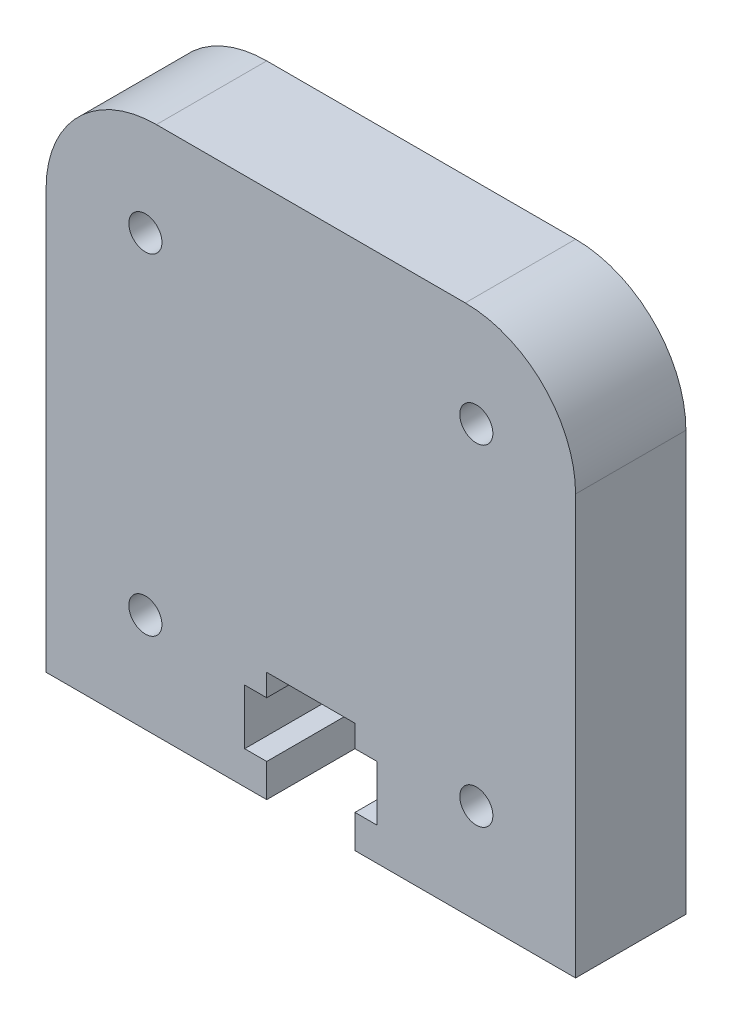
ISO-10303-21;
HEADER;
FILE_DESCRIPTION(('STEP AP214'),'2;1');
FILE_NAME('part.step','',(''),(''),'','','');
FILE_SCHEMA(('AUTOMOTIVE_DESIGN { 1 0 10303 214 1 1 1 1 }'));
ENDSEC;
DATA;
#1=APPLICATION_CONTEXT('core data for automotive mechanical design processes');
#2=APPLICATION_PROTOCOL_DEFINITION('international standard','automotive_design',2000,#1);
#3=PRODUCT_CONTEXT('',#1,'mechanical');
#4=PRODUCT('Part','Part','',(#3));
#5=PRODUCT_RELATED_PRODUCT_CATEGORY('part','',(#4));
#6=PRODUCT_DEFINITION_FORMATION('','',#4);
#7=PRODUCT_DEFINITION_CONTEXT('part definition',#1,'design');
#8=PRODUCT_DEFINITION('design','',#6,#7);
#9=PRODUCT_DEFINITION_SHAPE('','',#8);
#10=(LENGTH_UNIT() NAMED_UNIT(*) SI_UNIT(.MILLI.,.METRE.));
#11=(NAMED_UNIT(*) PLANE_ANGLE_UNIT() SI_UNIT($,.RADIAN.));
#12=(NAMED_UNIT(*) SI_UNIT($,.STERADIAN.) SOLID_ANGLE_UNIT());
#13=UNCERTAINTY_MEASURE_WITH_UNIT(LENGTH_MEASURE(1.E-05),#10,'distance_accuracy_value','');
#14=(GEOMETRIC_REPRESENTATION_CONTEXT(3) GLOBAL_UNCERTAINTY_ASSIGNED_CONTEXT((#13)) GLOBAL_UNIT_ASSIGNED_CONTEXT((#10,
#11,#12)) REPRESENTATION_CONTEXT('',''));
#15=CARTESIAN_POINT('',(0.,0.,0.));
#16=DIRECTION('',(0.,0.,1.));
#17=DIRECTION('',(1.,0.,0.));
#18=AXIS2_PLACEMENT_3D('',#15,#16,#17);
#19=CARTESIAN_POINT('',(-12.,-12.,5.));
#20=DIRECTION('',(0.,1.,0.));
#21=DIRECTION('',(0.,0.,1.));
#22=AXIS2_PLACEMENT_3D('',#19,#20,#21);
#23=PLANE('',#22);
#24=DIRECTION('',(1.,0.,0.));
#25=VECTOR('',#24,1.);
#26=CARTESIAN_POINT('',(-12.,-12.,0.));
#27=LINE('',#26,#25);
#28=CARTESIAN_POINT('',(-12.,-12.,0.));
#29=VERTEX_POINT('',#28);
#30=CARTESIAN_POINT('',(-2.,-12.,0.));
#31=VERTEX_POINT('',#30);
#32=EDGE_CURVE('E199',#29,#31,#27,.T.);
#33=ORIENTED_EDGE('',*,*,#32,.T.);
#34=DIRECTION('',(0.,0.,1.));
#35=VECTOR('',#34,1.);
#36=CARTESIAN_POINT('',(-2.,-12.,5.));
#37=LINE('',#36,#35);
#38=CARTESIAN_POINT('',(-2.,-12.,5.));
#39=VERTEX_POINT('',#38);
#40=EDGE_CURVE('E167',#31,#39,#37,.T.);
#41=ORIENTED_EDGE('',*,*,#40,.T.);
#42=DIRECTION('',(1.,0.,0.));
#43=VECTOR('',#42,1.);
#44=CARTESIAN_POINT('',(-12.,-12.,5.));
#45=LINE('',#44,#43);
#46=CARTESIAN_POINT('',(-12.,-12.,5.));
#47=VERTEX_POINT('',#46);
#48=EDGE_CURVE('E182',#47,#39,#45,.T.);
#49=ORIENTED_EDGE('',*,*,#48,.F.);
#50=DIRECTION('',(0.,0.,-1.));
#51=VECTOR('',#50,1.);
#52=CARTESIAN_POINT('',(-12.,-12.,5.));
#53=LINE('',#52,#51);
#54=EDGE_CURVE('E204',#47,#29,#53,.T.);
#55=ORIENTED_EDGE('',*,*,#54,.T.);
#56=EDGE_LOOP('',(#33,#41,#49,#55));
#57=FACE_BOUND('',#56,.T.);
#58=ADVANCED_FACE('F33',(#57),#23,.F.);
#59=CARTESIAN_POINT('',(0.,0.,5.));
#60=DIRECTION('',(0.,0.,1.));
#61=DIRECTION('',(1.,0.,0.));
#62=AXIS2_PLACEMENT_3D('',#59,#60,#61);
#63=PLANE('',#62);
#64=DIRECTION('',(0.,-1.,0.));
#65=VECTOR('',#64,1.);
#66=CARTESIAN_POINT('',(-2.,-12.,5.));
#67=LINE('',#66,#65);
#68=CARTESIAN_POINT('',(-2.,-10.5,5.));
#69=VERTEX_POINT('',#68);
#70=EDGE_CURVE('E284',#69,#39,#67,.T.);
#71=ORIENTED_EDGE('',*,*,#70,.F.);
#72=DIRECTION('',(1.,0.,0.));
#73=VECTOR('',#72,1.);
#74=CARTESIAN_POINT('',(-2.,-10.5,5.));
#75=LINE('',#74,#73);
#76=CARTESIAN_POINT('',(-3.,-10.5,5.));
#77=VERTEX_POINT('',#76);
#78=EDGE_CURVE('E332',#77,#69,#75,.T.);
#79=ORIENTED_EDGE('',*,*,#78,.F.);
#80=DIRECTION('',(0.,-1.,0.));
#81=VECTOR('',#80,1.);
#82=CARTESIAN_POINT('',(-3.,-10.5,5.));
#83=LINE('',#82,#81);
#84=CARTESIAN_POINT('',(-3.,-8.,5.));
#85=VERTEX_POINT('',#84);
#86=EDGE_CURVE('E335',#85,#77,#83,.T.);
#87=ORIENTED_EDGE('',*,*,#86,.F.);
#88=DIRECTION('',(-1.,0.,0.));
#89=VECTOR('',#88,1.);
#90=CARTESIAN_POINT('',(-3.,-8.,5.));
#91=LINE('',#90,#89);
#92=CARTESIAN_POINT('',(-2.,-8.,5.));
#93=VERTEX_POINT('',#92);
#94=EDGE_CURVE('E263',#93,#85,#91,.T.);
#95=ORIENTED_EDGE('',*,*,#94,.F.);
#96=DIRECTION('',(0.,-1.,0.));
#97=VECTOR('',#96,1.);
#98=CARTESIAN_POINT('',(-2.,-8.,5.));
#99=LINE('',#98,#97);
#100=CARTESIAN_POINT('',(-2.,-7.,5.));
#101=VERTEX_POINT('',#100);
#102=EDGE_CURVE('E342',#101,#93,#99,.T.);
#103=ORIENTED_EDGE('',*,*,#102,.F.);
#104=DIRECTION('',(-1.,0.,0.));
#105=VECTOR('',#104,1.);
#106=CARTESIAN_POINT('',(-2.,-7.,5.));
#107=LINE('',#106,#105);
#108=CARTESIAN_POINT('',(2.,-7.,5.));
#109=VERTEX_POINT('',#108);
#110=EDGE_CURVE('E347',#109,#101,#107,.T.);
#111=ORIENTED_EDGE('',*,*,#110,.F.);
#112=DIRECTION('',(0.,1.,0.));
#113=VECTOR('',#112,1.);
#114=CARTESIAN_POINT('',(2.,-7.,5.));
#115=LINE('',#114,#113);
#116=CARTESIAN_POINT('',(2.,-8.,5.));
#117=VERTEX_POINT('',#116);
#118=EDGE_CURVE('E350',#117,#109,#115,.T.);
#119=ORIENTED_EDGE('',*,*,#118,.F.);
#120=DIRECTION('',(-1.,0.,0.));
#121=VECTOR('',#120,1.);
#122=CARTESIAN_POINT('',(2.,-8.,5.));
#123=LINE('',#122,#121);
#124=CARTESIAN_POINT('',(3.,-8.,5.));
#125=VERTEX_POINT('',#124);
#126=EDGE_CURVE('E353',#125,#117,#123,.T.);
#127=ORIENTED_EDGE('',*,*,#126,.F.);
#128=DIRECTION('',(0.,1.,0.));
#129=VECTOR('',#128,1.);
#130=CARTESIAN_POINT('',(3.,-8.,5.));
#131=LINE('',#130,#129);
#132=CARTESIAN_POINT('',(3.,-10.5,5.));
#133=VERTEX_POINT('',#132);
#134=EDGE_CURVE('E356',#133,#125,#131,.T.);
#135=ORIENTED_EDGE('',*,*,#134,.F.);
#136=DIRECTION('',(1.,0.,0.));
#137=VECTOR('',#136,1.);
#138=CARTESIAN_POINT('',(3.,-10.5,5.));
#139=LINE('',#138,#137);
#140=CARTESIAN_POINT('',(2.,-10.5,5.));
#141=VERTEX_POINT('',#140);
#142=EDGE_CURVE('E177',#141,#133,#139,.T.);
#143=ORIENTED_EDGE('',*,*,#142,.F.);
#144=DIRECTION('',(0.,1.,0.));
#145=VECTOR('',#144,1.);
#146=CARTESIAN_POINT('',(2.,-10.5,5.));
#147=LINE('',#146,#145);
#148=CARTESIAN_POINT('',(2.,-12.,5.));
#149=VERTEX_POINT('',#148);
#150=EDGE_CURVE('E162',#149,#141,#147,.T.);
#151=ORIENTED_EDGE('',*,*,#150,.F.);
#152=CARTESIAN_POINT('',(12.,-12.,5.));
#153=VERTEX_POINT('',#152);
#154=EDGE_CURVE('E173',#149,#153,#45,.T.);
#155=ORIENTED_EDGE('',*,*,#154,.T.);
#156=DIRECTION('',(0.,1.,0.));
#157=VECTOR('',#156,1.);
#158=CARTESIAN_POINT('',(12.,12.,5.));
#159=LINE('',#158,#157);
#160=CARTESIAN_POINT('',(12.,7.,5.));
#161=VERTEX_POINT('',#160);
#162=EDGE_CURVE('E202',#153,#161,#159,.T.);
#163=ORIENTED_EDGE('',*,*,#162,.T.);
#164=CARTESIAN_POINT('',(6.99999999999999,7.,5.));
#165=DIRECTION('',(0.,0.,1.));
#166=DIRECTION('',(1.,0.,0.));
#167=AXIS2_PLACEMENT_3D('',#164,#165,#166);
#168=CIRCLE('',#167,5.);
#169=CARTESIAN_POINT('',(6.99999999999999,12.,5.));
#170=VERTEX_POINT('',#169);
#171=EDGE_CURVE('E219',#161,#170,#168,.T.);
#172=ORIENTED_EDGE('',*,*,#171,.T.);
#173=DIRECTION('',(-1.,0.,0.));
#174=VECTOR('',#173,1.);
#175=CARTESIAN_POINT('',(-12.,12.,5.));
#176=LINE('',#175,#174);
#177=CARTESIAN_POINT('',(-7.00000000000001,12.,5.));
#178=VERTEX_POINT('',#177);
#179=EDGE_CURVE('E186',#170,#178,#176,.T.);
#180=ORIENTED_EDGE('',*,*,#179,.T.);
#181=CARTESIAN_POINT('',(-7.00000000000001,7.,5.));
#182=DIRECTION('',(0.,0.,1.));
#183=DIRECTION('',(1.,0.,0.));
#184=AXIS2_PLACEMENT_3D('',#181,#182,#183);
#185=CIRCLE('',#184,5.);
#186=CARTESIAN_POINT('',(-12.,7.,5.));
#187=VERTEX_POINT('',#186);
#188=EDGE_CURVE('E221',#178,#187,#185,.T.);
#189=ORIENTED_EDGE('',*,*,#188,.T.);
#190=DIRECTION('',(0.,-1.,0.));
#191=VECTOR('',#190,1.);
#192=CARTESIAN_POINT('',(-12.,12.,5.));
#193=LINE('',#192,#191);
#194=EDGE_CURVE('E183',#187,#47,#193,.T.);
#195=ORIENTED_EDGE('',*,*,#194,.T.);
#196=ORIENTED_EDGE('',*,*,#48,.T.);
#197=EDGE_LOOP('',(#71,#79,#87,#95,#103,#111,#119,#127,#135,#143,#151,#155,#163,#172,#180,#189,
#195,#196));
#198=FACE_BOUND('',#197,.T.);
#199=CARTESIAN_POINT('',(7.50000000000016,-7.5,5.));
#200=DIRECTION('',(0.,0.,1.));
#201=DIRECTION('',(1.,0.,0.));
#202=AXIS2_PLACEMENT_3D('',#199,#200,#201);
#203=CIRCLE('',#202,0.749999999999999);
#204=CARTESIAN_POINT('',(8.25000000000016,-7.5,5.));
#205=VERTEX_POINT('',#204);
#206=EDGE_CURVE('E295',#205,#205,#203,.T.);
#207=ORIENTED_EDGE('',*,*,#206,.F.);
#208=EDGE_LOOP('',(#207));
#209=FACE_BOUND('',#208,.T.);
#210=CARTESIAN_POINT('',(-7.5,7.5,5.));
#211=DIRECTION('',(0.,0.,1.));
#212=DIRECTION('',(1.,0.,0.));
#213=AXIS2_PLACEMENT_3D('',#210,#211,#212);
#214=CIRCLE('',#213,0.749999999999999);
#215=CARTESIAN_POINT('',(-6.75,7.5,5.));
#216=VERTEX_POINT('',#215);
#217=EDGE_CURVE('E193',#216,#216,#214,.T.);
#218=ORIENTED_EDGE('',*,*,#217,.F.);
#219=EDGE_LOOP('',(#218));
#220=FACE_BOUND('',#219,.T.);
#221=CARTESIAN_POINT('',(7.5,7.5,5.));
#222=DIRECTION('',(0.,0.,1.));
#223=DIRECTION('',(1.,0.,0.));
#224=AXIS2_PLACEMENT_3D('',#221,#222,#223);
#225=CIRCLE('',#224,0.749999999999999);
#226=CARTESIAN_POINT('',(8.25,7.5,5.));
#227=VERTEX_POINT('',#226);
#228=EDGE_CURVE('E301',#227,#227,#225,.T.);
#229=ORIENTED_EDGE('',*,*,#228,.F.);
#230=EDGE_LOOP('',(#229));
#231=FACE_BOUND('',#230,.T.);
#232=CARTESIAN_POINT('',(-7.49999999999984,-7.5,5.));
#233=DIRECTION('',(0.,0.,1.));
#234=DIRECTION('',(1.,0.,0.));
#235=AXIS2_PLACEMENT_3D('',#232,#233,#234);
#236=CIRCLE('',#235,0.749999999999999);
#237=CARTESIAN_POINT('',(-6.74999999999984,-7.5,5.));
#238=VERTEX_POINT('',#237);
#239=EDGE_CURVE('E289',#238,#238,#236,.T.);
#240=ORIENTED_EDGE('',*,*,#239,.F.);
#241=EDGE_LOOP('',(#240));
#242=FACE_BOUND('',#241,.T.);
#243=ADVANCED_FACE('F171',(#198,#209,#220,#231,#242),#63,.T.);
#244=CARTESIAN_POINT('',(0.,0.,0.));
#245=DIRECTION('',(0.,0.,1.));
#246=DIRECTION('',(1.,0.,0.));
#247=AXIS2_PLACEMENT_3D('',#244,#245,#246);
#248=PLANE('',#247);
#249=DIRECTION('',(1.,0.,0.));
#250=VECTOR('',#249,1.);
#251=CARTESIAN_POINT('',(0.,-10.5,0.));
#252=LINE('',#251,#250);
#253=CARTESIAN_POINT('',(-3.,-10.5,0.));
#254=VERTEX_POINT('',#253);
#255=CARTESIAN_POINT('',(-2.,-10.5,0.));
#256=VERTEX_POINT('',#255);
#257=EDGE_CURVE('E11',#254,#256,#252,.T.);
#258=ORIENTED_EDGE('',*,*,#257,.T.);
#259=DIRECTION('',(0.,-1.,0.));
#260=VECTOR('',#259,1.);
#261=CARTESIAN_POINT('',(-2.,0.,0.));
#262=LINE('',#261,#260);
#263=EDGE_CURVE('E286',#256,#31,#262,.T.);
#264=ORIENTED_EDGE('',*,*,#263,.T.);
#265=ORIENTED_EDGE('',*,*,#32,.F.);
#266=DIRECTION('',(0.,-1.,0.));
#267=VECTOR('',#266,1.);
#268=CARTESIAN_POINT('',(-12.,12.,0.));
#269=LINE('',#268,#267);
#270=CARTESIAN_POINT('',(-12.,7.,0.));
#271=VERTEX_POINT('',#270);
#272=EDGE_CURVE('E196',#271,#29,#269,.T.);
#273=ORIENTED_EDGE('',*,*,#272,.F.);
#274=CARTESIAN_POINT('',(-7.00000000000001,7.,0.));
#275=DIRECTION('',(0.,0.,1.));
#276=DIRECTION('',(1.,0.,0.));
#277=AXIS2_PLACEMENT_3D('',#274,#275,#276);
#278=CIRCLE('',#277,5.);
#279=CARTESIAN_POINT('',(-7.00000000000001,12.,0.));
#280=VERTEX_POINT('',#279);
#281=EDGE_CURVE('E212',#271,#280,#278,.F.);
#282=ORIENTED_EDGE('',*,*,#281,.T.);
#283=DIRECTION('',(-1.,0.,0.));
#284=VECTOR('',#283,1.);
#285=CARTESIAN_POINT('',(-12.,12.,0.));
#286=LINE('',#285,#284);
#287=CARTESIAN_POINT('',(6.99999999999999,12.,0.));
#288=VERTEX_POINT('',#287);
#289=EDGE_CURVE('E192',#288,#280,#286,.T.);
#290=ORIENTED_EDGE('',*,*,#289,.F.);
#291=CARTESIAN_POINT('',(6.99999999999999,7.,0.));
#292=DIRECTION('',(0.,0.,1.));
#293=DIRECTION('',(1.,0.,0.));
#294=AXIS2_PLACEMENT_3D('',#291,#292,#293);
#295=CIRCLE('',#294,5.);
#296=CARTESIAN_POINT('',(12.,7.,0.));
#297=VERTEX_POINT('',#296);
#298=EDGE_CURVE('E210',#288,#297,#295,.F.);
#299=ORIENTED_EDGE('',*,*,#298,.T.);
#300=DIRECTION('',(0.,1.,0.));
#301=VECTOR('',#300,1.);
#302=CARTESIAN_POINT('',(12.,12.,0.));
#303=LINE('',#302,#301);
#304=CARTESIAN_POINT('',(12.,-12.,0.));
#305=VERTEX_POINT('',#304);
#306=EDGE_CURVE('E190',#305,#297,#303,.T.);
#307=ORIENTED_EDGE('',*,*,#306,.F.);
#308=CARTESIAN_POINT('',(2.,-12.,0.));
#309=VERTEX_POINT('',#308);
#310=EDGE_CURVE('E198',#309,#305,#27,.T.);
#311=ORIENTED_EDGE('',*,*,#310,.F.);
#312=DIRECTION('',(0.,1.,0.));
#313=VECTOR('',#312,1.);
#314=CARTESIAN_POINT('',(2.,0.,0.));
#315=LINE('',#314,#313);
#316=CARTESIAN_POINT('',(2.,-10.5,0.));
#317=VERTEX_POINT('',#316);
#318=EDGE_CURVE('E48',#309,#317,#315,.T.);
#319=ORIENTED_EDGE('',*,*,#318,.T.);
#320=DIRECTION('',(1.,0.,0.));
#321=VECTOR('',#320,1.);
#322=CARTESIAN_POINT('',(0.,-10.5,0.));
#323=LINE('',#322,#321);
#324=CARTESIAN_POINT('',(3.,-10.5,0.));
#325=VERTEX_POINT('',#324);
#326=EDGE_CURVE('E226',#317,#325,#323,.T.);
#327=ORIENTED_EDGE('',*,*,#326,.T.);
#328=DIRECTION('',(0.,1.,0.));
#329=VECTOR('',#328,1.);
#330=CARTESIAN_POINT('',(3.,0.,0.));
#331=LINE('',#330,#329);
#332=CARTESIAN_POINT('',(3.,-8.,0.));
#333=VERTEX_POINT('',#332);
#334=EDGE_CURVE('E229',#325,#333,#331,.T.);
#335=ORIENTED_EDGE('',*,*,#334,.T.);
#336=DIRECTION('',(-1.,0.,0.));
#337=VECTOR('',#336,1.);
#338=CARTESIAN_POINT('',(0.,-8.,0.));
#339=LINE('',#338,#337);
#340=CARTESIAN_POINT('',(2.,-8.,0.));
#341=VERTEX_POINT('',#340);
#342=EDGE_CURVE('E232',#333,#341,#339,.T.);
#343=ORIENTED_EDGE('',*,*,#342,.T.);
#344=DIRECTION('',(0.,1.,0.));
#345=VECTOR('',#344,1.);
#346=CARTESIAN_POINT('',(2.,0.,0.));
#347=LINE('',#346,#345);
#348=CARTESIAN_POINT('',(2.,-7.,0.));
#349=VERTEX_POINT('',#348);
#350=EDGE_CURVE('E235',#341,#349,#347,.T.);
#351=ORIENTED_EDGE('',*,*,#350,.T.);
#352=DIRECTION('',(-1.,0.,0.));
#353=VECTOR('',#352,1.);
#354=CARTESIAN_POINT('',(0.,-7.,0.));
#355=LINE('',#354,#353);
#356=CARTESIAN_POINT('',(-2.,-7.,0.));
#357=VERTEX_POINT('',#356);
#358=EDGE_CURVE('E238',#349,#357,#355,.T.);
#359=ORIENTED_EDGE('',*,*,#358,.T.);
#360=DIRECTION('',(0.,-1.,0.));
#361=VECTOR('',#360,1.);
#362=CARTESIAN_POINT('',(-2.,0.,0.));
#363=LINE('',#362,#361);
#364=CARTESIAN_POINT('',(-2.,-8.,0.));
#365=VERTEX_POINT('',#364);
#366=EDGE_CURVE('E241',#357,#365,#363,.T.);
#367=ORIENTED_EDGE('',*,*,#366,.T.);
#368=DIRECTION('',(-1.,0.,0.));
#369=VECTOR('',#368,1.);
#370=CARTESIAN_POINT('',(0.,-8.,0.));
#371=LINE('',#370,#369);
#372=CARTESIAN_POINT('',(-3.,-8.,0.));
#373=VERTEX_POINT('',#372);
#374=EDGE_CURVE('E244',#365,#373,#371,.T.);
#375=ORIENTED_EDGE('',*,*,#374,.T.);
#376=DIRECTION('',(0.,-1.,0.));
#377=VECTOR('',#376,1.);
#378=CARTESIAN_POINT('',(-3.,0.,0.));
#379=LINE('',#378,#377);
#380=EDGE_CURVE('E41',#373,#254,#379,.T.);
#381=ORIENTED_EDGE('',*,*,#380,.T.);
#382=EDGE_LOOP('',(#258,#264,#265,#273,#282,#290,#299,#307,#311,#319,#327,#335,#343,#351,#359,
#367,#375,#381));
#383=FACE_BOUND('',#382,.T.);
#384=CARTESIAN_POINT('',(-7.5,7.5,0.));
#385=DIRECTION('',(0.,0.,1.));
#386=DIRECTION('',(1.,0.,0.));
#387=AXIS2_PLACEMENT_3D('',#384,#385,#386);
#388=CIRCLE('',#387,0.749999999999999);
#389=CARTESIAN_POINT('',(-6.75,7.5,0.));
#390=VERTEX_POINT('',#389);
#391=EDGE_CURVE('E304',#390,#390,#388,.T.);
#392=ORIENTED_EDGE('',*,*,#391,.T.);
#393=EDGE_LOOP('',(#392));
#394=FACE_BOUND('',#393,.T.);
#395=CARTESIAN_POINT('',(7.5,7.5,0.));
#396=DIRECTION('',(0.,0.,1.));
#397=DIRECTION('',(1.,0.,0.));
#398=AXIS2_PLACEMENT_3D('',#395,#396,#397);
#399=CIRCLE('',#398,0.749999999999999);
#400=CARTESIAN_POINT('',(8.25,7.5,0.));
#401=VERTEX_POINT('',#400);
#402=EDGE_CURVE('E298',#401,#401,#399,.T.);
#403=ORIENTED_EDGE('',*,*,#402,.T.);
#404=EDGE_LOOP('',(#403));
#405=FACE_BOUND('',#404,.T.);
#406=CARTESIAN_POINT('',(7.50000000000016,-7.5,0.));
#407=DIRECTION('',(0.,0.,1.));
#408=DIRECTION('',(1.,0.,0.));
#409=AXIS2_PLACEMENT_3D('',#406,#407,#408);
#410=CIRCLE('',#409,0.749999999999999);
#411=CARTESIAN_POINT('',(8.25000000000016,-7.5,0.));
#412=VERTEX_POINT('',#411);
#413=EDGE_CURVE('E292',#412,#412,#410,.T.);
#414=ORIENTED_EDGE('',*,*,#413,.T.);
#415=EDGE_LOOP('',(#414));
#416=FACE_BOUND('',#415,.T.);
#417=CARTESIAN_POINT('',(-7.49999999999984,-7.5,0.));
#418=DIRECTION('',(0.,0.,1.));
#419=DIRECTION('',(1.,0.,0.));
#420=AXIS2_PLACEMENT_3D('',#417,#418,#419);
#421=CIRCLE('',#420,0.749999999999999);
#422=CARTESIAN_POINT('',(-6.74999999999984,-7.5,0.));
#423=VERTEX_POINT('',#422);
#424=EDGE_CURVE('E288',#423,#423,#421,.T.);
#425=ORIENTED_EDGE('',*,*,#424,.T.);
#426=EDGE_LOOP('',(#425));
#427=FACE_BOUND('',#426,.T.);
#428=ADVANCED_FACE('F248',(#383,#394,#405,#416,#427),#248,.F.);
#429=CARTESIAN_POINT('',(12.,12.,5.));
#430=DIRECTION('',(-1.,0.,0.));
#431=DIRECTION('',(0.,-1.,0.));
#432=AXIS2_PLACEMENT_3D('',#429,#430,#431);
#433=PLANE('',#432);
#434=ORIENTED_EDGE('',*,*,#306,.T.);
#435=DIRECTION('',(0.,0.,-1.));
#436=VECTOR('',#435,1.);
#437=CARTESIAN_POINT('',(12.,7.,5.));
#438=LINE('',#437,#436);
#439=EDGE_CURVE('E56',#297,#161,#438,.F.);
#440=ORIENTED_EDGE('',*,*,#439,.T.);
#441=ORIENTED_EDGE('',*,*,#162,.F.);
#442=DIRECTION('',(0.,0.,-1.));
#443=VECTOR('',#442,1.);
#444=CARTESIAN_POINT('',(12.,-12.,5.));
#445=LINE('',#444,#443);
#446=EDGE_CURVE('E181',#153,#305,#445,.T.);
#447=ORIENTED_EDGE('',*,*,#446,.T.);
#448=EDGE_LOOP('',(#434,#440,#441,#447));
#449=FACE_BOUND('',#448,.T.);
#450=ADVANCED_FACE('F368',(#449),#433,.F.);
#451=CARTESIAN_POINT('',(-12.,12.,5.));
#452=DIRECTION('',(0.,-1.,0.));
#453=DIRECTION('',(0.,0.,-1.));
#454=AXIS2_PLACEMENT_3D('',#451,#452,#453);
#455=PLANE('',#454);
#456=ORIENTED_EDGE('',*,*,#289,.T.);
#457=DIRECTION('',(0.,0.,-1.));
#458=VECTOR('',#457,1.);
#459=CARTESIAN_POINT('',(-7.00000000000001,12.,5.));
#460=LINE('',#459,#458);
#461=EDGE_CURVE('E217',#280,#178,#460,.F.);
#462=ORIENTED_EDGE('',*,*,#461,.T.);
#463=ORIENTED_EDGE('',*,*,#179,.F.);
#464=DIRECTION('',(0.,0.,-1.));
#465=VECTOR('',#464,1.);
#466=CARTESIAN_POINT('',(6.99999999999999,12.,5.));
#467=LINE('',#466,#465);
#468=EDGE_CURVE('E214',#170,#288,#467,.T.);
#469=ORIENTED_EDGE('',*,*,#468,.T.);
#470=EDGE_LOOP('',(#456,#462,#463,#469));
#471=FACE_BOUND('',#470,.T.);
#472=ADVANCED_FACE('F370',(#471),#455,.F.);
#473=CARTESIAN_POINT('',(-12.,12.,5.));
#474=DIRECTION('',(1.,0.,0.));
#475=DIRECTION('',(0.,1.,0.));
#476=AXIS2_PLACEMENT_3D('',#473,#474,#475);
#477=PLANE('',#476);
#478=ORIENTED_EDGE('',*,*,#194,.F.);
#479=DIRECTION('',(0.,0.,-1.));
#480=VECTOR('',#479,1.);
#481=CARTESIAN_POINT('',(-12.,7.,5.));
#482=LINE('',#481,#480);
#483=EDGE_CURVE('E207',#187,#271,#482,.T.);
#484=ORIENTED_EDGE('',*,*,#483,.T.);
#485=ORIENTED_EDGE('',*,*,#272,.T.);
#486=ORIENTED_EDGE('',*,*,#54,.F.);
#487=EDGE_LOOP('',(#478,#484,#485,#486));
#488=FACE_BOUND('',#487,.T.);
#489=ADVANCED_FACE('F324',(#488),#477,.F.);
#490=ORIENTED_EDGE('',*,*,#154,.F.);
#491=DIRECTION('',(0.,0.,-1.));
#492=VECTOR('',#491,1.);
#493=CARTESIAN_POINT('',(2.,-12.,5.));
#494=LINE('',#493,#492);
#495=EDGE_CURVE('E159',#149,#309,#494,.T.);
#496=ORIENTED_EDGE('',*,*,#495,.T.);
#497=ORIENTED_EDGE('',*,*,#310,.T.);
#498=ORIENTED_EDGE('',*,*,#446,.F.);
#499=EDGE_LOOP('',(#490,#496,#497,#498));
#500=FACE_BOUND('',#499,.T.);
#501=ADVANCED_FACE('F179',(#500),#23,.F.);
#502=CARTESIAN_POINT('',(-7.5,7.5,5.));
#503=DIRECTION('',(0.,0.,-1.));
#504=DIRECTION('',(-1.,0.,0.));
#505=AXIS2_PLACEMENT_3D('',#502,#503,#504);
#506=CYLINDRICAL_SURFACE('',#505,0.749999999999999);
#507=ORIENTED_EDGE('',*,*,#217,.T.);
#508=EDGE_LOOP('',(#507));
#509=FACE_BOUND('',#508,.T.);
#510=ORIENTED_EDGE('',*,*,#391,.F.);
#511=EDGE_LOOP('',(#510));
#512=FACE_BOUND('',#511,.T.);
#513=ADVANCED_FACE('F388',(#509,#512),#506,.F.);
#514=CARTESIAN_POINT('',(7.5,7.5,5.));
#515=DIRECTION('',(0.,0.,-1.));
#516=DIRECTION('',(-1.,0.,0.));
#517=AXIS2_PLACEMENT_3D('',#514,#515,#516);
#518=CYLINDRICAL_SURFACE('',#517,0.749999999999999);
#519=ORIENTED_EDGE('',*,*,#228,.T.);
#520=EDGE_LOOP('',(#519));
#521=FACE_BOUND('',#520,.T.);
#522=ORIENTED_EDGE('',*,*,#402,.F.);
#523=EDGE_LOOP('',(#522));
#524=FACE_BOUND('',#523,.T.);
#525=ADVANCED_FACE('F394',(#521,#524),#518,.F.);
#526=CARTESIAN_POINT('',(7.50000000000016,-7.5,5.));
#527=DIRECTION('',(0.,0.,-1.));
#528=DIRECTION('',(-1.,0.,0.));
#529=AXIS2_PLACEMENT_3D('',#526,#527,#528);
#530=CYLINDRICAL_SURFACE('',#529,0.749999999999999);
#531=ORIENTED_EDGE('',*,*,#206,.T.);
#532=EDGE_LOOP('',(#531));
#533=FACE_BOUND('',#532,.T.);
#534=ORIENTED_EDGE('',*,*,#413,.F.);
#535=EDGE_LOOP('',(#534));
#536=FACE_BOUND('',#535,.T.);
#537=ADVANCED_FACE('F400',(#533,#536),#530,.F.);
#538=CARTESIAN_POINT('',(-7.49999999999984,-7.5,5.));
#539=DIRECTION('',(0.,0.,-1.));
#540=DIRECTION('',(-1.,0.,0.));
#541=AXIS2_PLACEMENT_3D('',#538,#539,#540);
#542=CYLINDRICAL_SURFACE('',#541,0.749999999999999);
#543=ORIENTED_EDGE('',*,*,#239,.T.);
#544=EDGE_LOOP('',(#543));
#545=FACE_BOUND('',#544,.T.);
#546=ORIENTED_EDGE('',*,*,#424,.F.);
#547=EDGE_LOOP('',(#546));
#548=FACE_BOUND('',#547,.T.);
#549=ADVANCED_FACE('F452',(#545,#548),#542,.F.);
#550=CARTESIAN_POINT('',(-7.00000000000001,7.,5.));
#551=DIRECTION('',(0.,0.,-1.));
#552=DIRECTION('',(-1.,0.,0.));
#553=AXIS2_PLACEMENT_3D('',#550,#551,#552);
#554=CYLINDRICAL_SURFACE('',#553,5.);
#555=ORIENTED_EDGE('',*,*,#188,.F.);
#556=ORIENTED_EDGE('',*,*,#461,.F.);
#557=ORIENTED_EDGE('',*,*,#281,.F.);
#558=ORIENTED_EDGE('',*,*,#483,.F.);
#559=EDGE_LOOP('',(#555,#556,#557,#558));
#560=FACE_BOUND('',#559,.T.);
#561=ADVANCED_FACE('F321',(#560),#554,.T.);
#562=CARTESIAN_POINT('',(6.99999999999999,7.,5.));
#563=DIRECTION('',(0.,0.,-1.));
#564=DIRECTION('',(-1.,0.,0.));
#565=AXIS2_PLACEMENT_3D('',#562,#563,#564);
#566=CYLINDRICAL_SURFACE('',#565,5.);
#567=ORIENTED_EDGE('',*,*,#171,.F.);
#568=ORIENTED_EDGE('',*,*,#439,.F.);
#569=ORIENTED_EDGE('',*,*,#298,.F.);
#570=ORIENTED_EDGE('',*,*,#468,.F.);
#571=EDGE_LOOP('',(#567,#568,#569,#570));
#572=FACE_BOUND('',#571,.T.);
#573=ADVANCED_FACE('F35',(#572),#566,.T.);
#574=CARTESIAN_POINT('',(-2.,-10.5,-5.));
#575=DIRECTION('',(0.,-1.,0.));
#576=DIRECTION('',(1.,0.,0.));
#577=AXIS2_PLACEMENT_3D('',#574,#575,#576);
#578=PLANE('',#577);
#579=DIRECTION('',(0.,0.,1.));
#580=VECTOR('',#579,1.);
#581=CARTESIAN_POINT('',(-3.,-10.5,-5.));
#582=LINE('',#581,#580);
#583=EDGE_CURVE('E258',#254,#77,#582,.T.);
#584=ORIENTED_EDGE('',*,*,#583,.T.);
#585=ORIENTED_EDGE('',*,*,#78,.T.);
#586=DIRECTION('',(0.,0.,1.));
#587=VECTOR('',#586,1.);
#588=CARTESIAN_POINT('',(-2.,-10.5,-5.));
#589=LINE('',#588,#587);
#590=EDGE_CURVE('E267',#256,#69,#589,.T.);
#591=ORIENTED_EDGE('',*,*,#590,.F.);
#592=ORIENTED_EDGE('',*,*,#257,.F.);
#593=EDGE_LOOP('',(#584,#585,#591,#592));
#594=FACE_BOUND('',#593,.T.);
#595=ADVANCED_FACE('F341',(#594),#578,.F.);
#596=CARTESIAN_POINT('',(-3.,-10.5,-5.));
#597=DIRECTION('',(-1.,0.,0.));
#598=DIRECTION('',(0.,-1.,0.));
#599=AXIS2_PLACEMENT_3D('',#596,#597,#598);
#600=PLANE('',#599);
#601=DIRECTION('',(0.,0.,1.));
#602=VECTOR('',#601,1.);
#603=CARTESIAN_POINT('',(-3.,-8.,-5.));
#604=LINE('',#603,#602);
#605=EDGE_CURVE('E256',#373,#85,#604,.T.);
#606=ORIENTED_EDGE('',*,*,#605,.T.);
#607=ORIENTED_EDGE('',*,*,#86,.T.);
#608=ORIENTED_EDGE('',*,*,#583,.F.);
#609=ORIENTED_EDGE('',*,*,#380,.F.);
#610=EDGE_LOOP('',(#606,#607,#608,#609));
#611=FACE_BOUND('',#610,.T.);
#612=ADVANCED_FACE('F254',(#611),#600,.F.);
#613=CARTESIAN_POINT('',(-3.,-8.,-5.));
#614=DIRECTION('',(0.,1.,0.));
#615=DIRECTION('',(0.,0.,1.));
#616=AXIS2_PLACEMENT_3D('',#613,#614,#615);
#617=PLANE('',#616);
#618=DIRECTION('',(0.,0.,1.));
#619=VECTOR('',#618,1.);
#620=CARTESIAN_POINT('',(-2.,-8.,-5.));
#621=LINE('',#620,#619);
#622=EDGE_CURVE('E265',#365,#93,#621,.T.);
#623=ORIENTED_EDGE('',*,*,#622,.T.);
#624=ORIENTED_EDGE('',*,*,#94,.T.);
#625=ORIENTED_EDGE('',*,*,#605,.F.);
#626=ORIENTED_EDGE('',*,*,#374,.F.);
#627=EDGE_LOOP('',(#623,#624,#625,#626));
#628=FACE_BOUND('',#627,.T.);
#629=ADVANCED_FACE('F260',(#628),#617,.F.);
#630=CARTESIAN_POINT('',(-2.,-8.,-5.));
#631=DIRECTION('',(-1.,0.,0.));
#632=DIRECTION('',(0.,0.,1.));
#633=AXIS2_PLACEMENT_3D('',#630,#631,#632);
#634=PLANE('',#633);
#635=DIRECTION('',(0.,0.,1.));
#636=VECTOR('',#635,1.);
#637=CARTESIAN_POINT('',(-2.,-7.,-5.));
#638=LINE('',#637,#636);
#639=EDGE_CURVE('E269',#357,#101,#638,.T.);
#640=ORIENTED_EDGE('',*,*,#639,.T.);
#641=ORIENTED_EDGE('',*,*,#102,.T.);
#642=ORIENTED_EDGE('',*,*,#622,.F.);
#643=ORIENTED_EDGE('',*,*,#366,.F.);
#644=EDGE_LOOP('',(#640,#641,#642,#643));
#645=FACE_BOUND('',#644,.T.);
#646=ADVANCED_FACE('F494',(#645),#634,.F.);
#647=CARTESIAN_POINT('',(-2.,-7.,-5.));
#648=DIRECTION('',(0.,1.,0.));
#649=DIRECTION('',(-1.,0.,0.));
#650=AXIS2_PLACEMENT_3D('',#647,#648,#649);
#651=PLANE('',#650);
#652=DIRECTION('',(0.,0.,1.));
#653=VECTOR('',#652,1.);
#654=CARTESIAN_POINT('',(2.,-7.,-5.));
#655=LINE('',#654,#653);
#656=EDGE_CURVE('E274',#349,#109,#655,.T.);
#657=ORIENTED_EDGE('',*,*,#656,.T.);
#658=ORIENTED_EDGE('',*,*,#110,.T.);
#659=ORIENTED_EDGE('',*,*,#639,.F.);
#660=ORIENTED_EDGE('',*,*,#358,.F.);
#661=EDGE_LOOP('',(#657,#658,#659,#660));
#662=FACE_BOUND('',#661,.T.);
#663=ADVANCED_FACE('F502',(#662),#651,.F.);
#664=CARTESIAN_POINT('',(2.,-7.,-5.));
#665=DIRECTION('',(1.,0.,0.));
#666=DIRECTION('',(0.,0.,-1.));
#667=AXIS2_PLACEMENT_3D('',#664,#665,#666);
#668=PLANE('',#667);
#669=DIRECTION('',(0.,0.,1.));
#670=VECTOR('',#669,1.);
#671=CARTESIAN_POINT('',(2.,-8.,-5.));
#672=LINE('',#671,#670);
#673=EDGE_CURVE('E276',#341,#117,#672,.T.);
#674=ORIENTED_EDGE('',*,*,#673,.T.);
#675=ORIENTED_EDGE('',*,*,#118,.T.);
#676=ORIENTED_EDGE('',*,*,#656,.F.);
#677=ORIENTED_EDGE('',*,*,#350,.F.);
#678=EDGE_LOOP('',(#674,#675,#676,#677));
#679=FACE_BOUND('',#678,.T.);
#680=ADVANCED_FACE('F511',(#679),#668,.F.);
#681=CARTESIAN_POINT('',(2.,-8.,-5.));
#682=DIRECTION('',(0.,1.,0.));
#683=DIRECTION('',(0.,0.,1.));
#684=AXIS2_PLACEMENT_3D('',#681,#682,#683);
#685=PLANE('',#684);
#686=DIRECTION('',(0.,0.,1.));
#687=VECTOR('',#686,1.);
#688=CARTESIAN_POINT('',(3.,-8.,-5.));
#689=LINE('',#688,#687);
#690=EDGE_CURVE('E278',#333,#125,#689,.T.);
#691=ORIENTED_EDGE('',*,*,#690,.T.);
#692=ORIENTED_EDGE('',*,*,#126,.T.);
#693=ORIENTED_EDGE('',*,*,#673,.F.);
#694=ORIENTED_EDGE('',*,*,#342,.F.);
#695=EDGE_LOOP('',(#691,#692,#693,#694));
#696=FACE_BOUND('',#695,.T.);
#697=ADVANCED_FACE('F520',(#696),#685,.F.);
#698=CARTESIAN_POINT('',(3.,-8.,-5.));
#699=DIRECTION('',(1.,0.,0.));
#700=DIRECTION('',(0.,1.,0.));
#701=AXIS2_PLACEMENT_3D('',#698,#699,#700);
#702=PLANE('',#701);
#703=DIRECTION('',(0.,0.,1.));
#704=VECTOR('',#703,1.);
#705=CARTESIAN_POINT('',(3.,-10.5,-5.));
#706=LINE('',#705,#704);
#707=EDGE_CURVE('E280',#325,#133,#706,.T.);
#708=ORIENTED_EDGE('',*,*,#707,.T.);
#709=ORIENTED_EDGE('',*,*,#134,.T.);
#710=ORIENTED_EDGE('',*,*,#690,.F.);
#711=ORIENTED_EDGE('',*,*,#334,.F.);
#712=EDGE_LOOP('',(#708,#709,#710,#711));
#713=FACE_BOUND('',#712,.T.);
#714=ADVANCED_FACE('F366',(#713),#702,.F.);
#715=CARTESIAN_POINT('',(3.,-10.5,-5.));
#716=DIRECTION('',(0.,-1.,0.));
#717=DIRECTION('',(0.,0.,-1.));
#718=AXIS2_PLACEMENT_3D('',#715,#716,#717);
#719=PLANE('',#718);
#720=DIRECTION('',(0.,0.,1.));
#721=VECTOR('',#720,1.);
#722=CARTESIAN_POINT('',(2.,-10.5,-5.));
#723=LINE('',#722,#721);
#724=EDGE_CURVE('E282',#317,#141,#723,.T.);
#725=ORIENTED_EDGE('',*,*,#724,.T.);
#726=ORIENTED_EDGE('',*,*,#142,.T.);
#727=ORIENTED_EDGE('',*,*,#707,.F.);
#728=ORIENTED_EDGE('',*,*,#326,.F.);
#729=EDGE_LOOP('',(#725,#726,#727,#728));
#730=FACE_BOUND('',#729,.T.);
#731=ADVANCED_FACE('F361',(#730),#719,.F.);
#732=CARTESIAN_POINT('',(-2.,-12.,-5.));
#733=DIRECTION('',(-1.,0.,0.));
#734=DIRECTION('',(0.,0.,1.));
#735=AXIS2_PLACEMENT_3D('',#732,#733,#734);
#736=PLANE('',#735);
#737=ORIENTED_EDGE('',*,*,#590,.T.);
#738=ORIENTED_EDGE('',*,*,#70,.T.);
#739=ORIENTED_EDGE('',*,*,#40,.F.);
#740=ORIENTED_EDGE('',*,*,#263,.F.);
#741=EDGE_LOOP('',(#737,#738,#739,#740));
#742=FACE_BOUND('',#741,.T.);
#743=ADVANCED_FACE('F339',(#742),#736,.F.);
#744=CARTESIAN_POINT('',(2.,-10.5,-5.));
#745=DIRECTION('',(1.,0.,0.));
#746=DIRECTION('',(0.,1.,0.));
#747=AXIS2_PLACEMENT_3D('',#744,#745,#746);
#748=PLANE('',#747);
#749=ORIENTED_EDGE('',*,*,#495,.F.);
#750=ORIENTED_EDGE('',*,*,#150,.T.);
#751=ORIENTED_EDGE('',*,*,#724,.F.);
#752=ORIENTED_EDGE('',*,*,#318,.F.);
#753=EDGE_LOOP('',(#749,#750,#751,#752));
#754=FACE_BOUND('',#753,.T.);
#755=ADVANCED_FACE('F161',(#754),#748,.F.);
#756=CLOSED_SHELL('',(#58,#243,#428,#450,#472,#489,#501,#513,#525,#537,#549,#561,#573,#595,#612,
#629,#646,#663,#680,#697,#714,#731,#743,#755));
#757=MANIFOLD_SOLID_BREP('B2',#756);
#758=ADVANCED_BREP_SHAPE_REPRESENTATION('',(#18,#757),#14);
#759=SHAPE_DEFINITION_REPRESENTATION(#9,#758);
ENDSEC;
END-ISO-10303-21;
